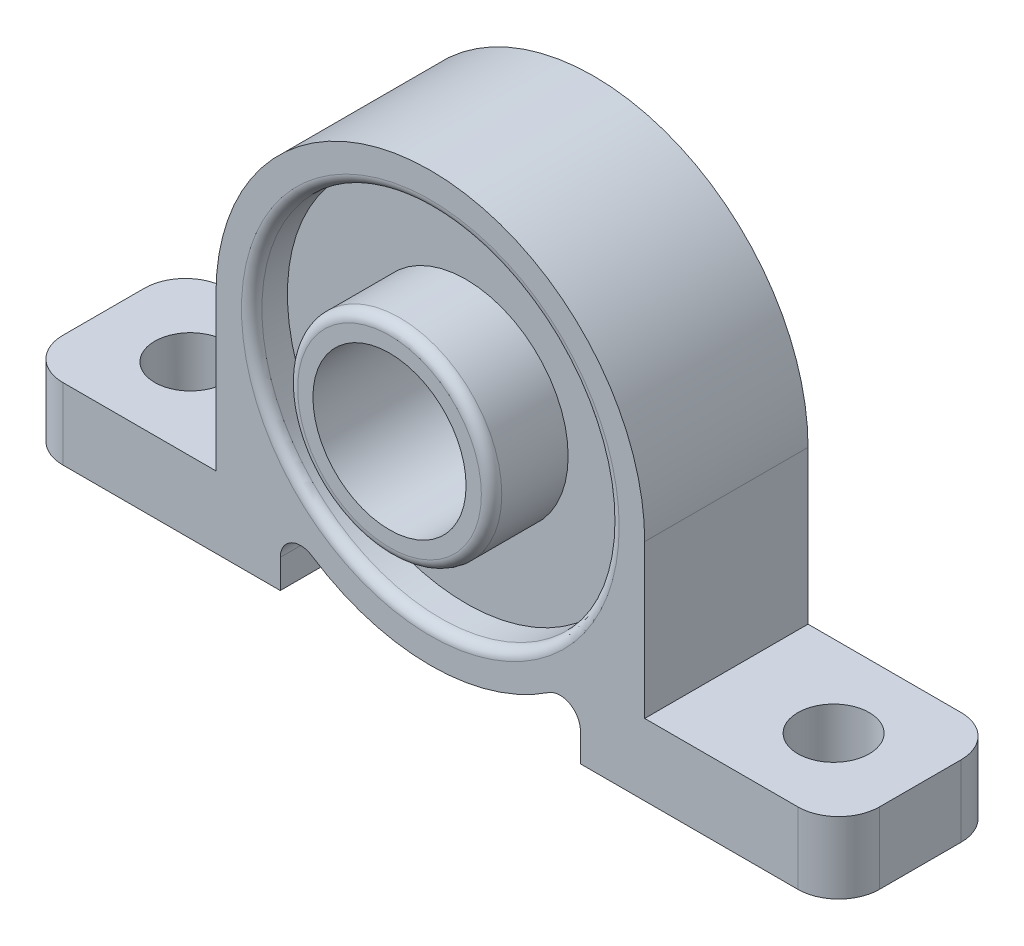
ISO-10303-21;
HEADER;
FILE_DESCRIPTION(('STEP AP214'),'2;1');
FILE_NAME('part.step','',(''),(''),'','','');
FILE_SCHEMA(('AUTOMOTIVE_DESIGN { 1 0 10303 214 1 1 1 1 }'));
ENDSEC;
DATA;
#1=APPLICATION_CONTEXT('core data for automotive mechanical design processes');
#2=APPLICATION_PROTOCOL_DEFINITION('international standard','automotive_design',2000,#1);
#3=PRODUCT_CONTEXT('',#1,'mechanical');
#4=PRODUCT('Part','Part','',(#3));
#5=PRODUCT_RELATED_PRODUCT_CATEGORY('part','',(#4));
#6=PRODUCT_DEFINITION_FORMATION('','',#4);
#7=PRODUCT_DEFINITION_CONTEXT('part definition',#1,'design');
#8=PRODUCT_DEFINITION('design','',#6,#7);
#9=PRODUCT_DEFINITION_SHAPE('','',#8);
#10=(LENGTH_UNIT() NAMED_UNIT(*) SI_UNIT(.MILLI.,.METRE.));
#11=(NAMED_UNIT(*) PLANE_ANGLE_UNIT() SI_UNIT($,.RADIAN.));
#12=(NAMED_UNIT(*) SI_UNIT($,.STERADIAN.) SOLID_ANGLE_UNIT());
#13=UNCERTAINTY_MEASURE_WITH_UNIT(LENGTH_MEASURE(1.E-05),#10,'distance_accuracy_value','');
#14=(GEOMETRIC_REPRESENTATION_CONTEXT(3) GLOBAL_UNCERTAINTY_ASSIGNED_CONTEXT((#13)) GLOBAL_UNIT_ASSIGNED_CONTEXT((#10,
#11,#12)) REPRESENTATION_CONTEXT('',''));
#15=CARTESIAN_POINT('',(0.,0.,0.));
#16=DIRECTION('',(0.,0.,1.));
#17=DIRECTION('',(1.,0.,0.));
#18=AXIS2_PLACEMENT_3D('',#15,#16,#17);
#19=CARTESIAN_POINT('',(0.,15.,16.));
#20=DIRECTION('',(0.,0.,-1.));
#21=DIRECTION('',(-1.,0.,0.));
#22=AXIS2_PLACEMENT_3D('',#19,#20,#21);
#23=CYLINDRICAL_SURFACE('',#22,7.5);
#24=CARTESIAN_POINT('',(0.,15.,4.5));
#25=DIRECTION('',(0.,0.,-1.));
#26=DIRECTION('',(-1.,0.,0.));
#27=AXIS2_PLACEMENT_3D('',#24,#25,#26);
#28=CIRCLE('',#27,7.5);
#29=CARTESIAN_POINT('',(-7.5,15.,4.5));
#30=VERTEX_POINT('',#29);
#31=EDGE_CURVE('E305',#30,#30,#28,.T.);
#32=ORIENTED_EDGE('',*,*,#31,.T.);
#33=EDGE_LOOP('',(#32));
#34=FACE_BOUND('',#33,.T.);
#35=CARTESIAN_POINT('',(0.,15.,20.));
#36=DIRECTION('',(0.,0.,1.));
#37=DIRECTION('',(1.,0.,0.));
#38=AXIS2_PLACEMENT_3D('',#35,#36,#37);
#39=CIRCLE('',#38,7.5);
#40=CARTESIAN_POINT('',(7.5,15.,20.));
#41=VERTEX_POINT('',#40);
#42=EDGE_CURVE('E213',#41,#41,#39,.T.);
#43=ORIENTED_EDGE('',*,*,#42,.T.);
#44=EDGE_LOOP('',(#43));
#45=FACE_BOUND('',#44,.T.);
#46=ADVANCED_FACE('F35',(#34,#45),#23,.F.);
#47=CARTESIAN_POINT('',(0.,15.,16.));
#48=DIRECTION('',(0.,0.,1.));
#49=DIRECTION('',(1.,0.,0.));
#50=AXIS2_PLACEMENT_3D('',#47,#48,#49);
#51=PLANE('',#50);
#52=CARTESIAN_POINT('',(0.,15.,16.));
#53=DIRECTION('',(0.,0.,1.));
#54=DIRECTION('',(1.,0.,0.));
#55=AXIS2_PLACEMENT_3D('',#52,#53,#54);
#56=CIRCLE('',#55,18.5);
#57=CARTESIAN_POINT('',(18.5,15.,16.));
#58=VERTEX_POINT('',#57);
#59=EDGE_CURVE('E320',#58,#58,#56,.F.);
#60=ORIENTED_EDGE('',*,*,#59,.T.);
#61=EDGE_LOOP('',(#60));
#62=FACE_BOUND('',#61,.T.);
#63=DIRECTION('',(-1.,0.,0.));
#64=VECTOR('',#63,1.);
#65=CARTESIAN_POINT('',(-40.,0.,16.));
#66=LINE('',#65,#64);
#67=CARTESIAN_POINT('',(-21.,0.,16.));
#68=VERTEX_POINT('',#67);
#69=CARTESIAN_POINT('',(-36.,0.,16.));
#70=VERTEX_POINT('',#69);
#71=EDGE_CURVE('E208',#68,#70,#66,.T.);
#72=ORIENTED_EDGE('',*,*,#71,.T.);
#73=DIRECTION('',(0.,-1.,0.));
#74=VECTOR('',#73,1.);
#75=CARTESIAN_POINT('',(-36.,-7.,16.));
#76=LINE('',#75,#74);
#77=CARTESIAN_POINT('',(-36.,-7.,16.));
#78=VERTEX_POINT('',#77);
#79=EDGE_CURVE('E172',#70,#78,#76,.T.);
#80=ORIENTED_EDGE('',*,*,#79,.T.);
#81=DIRECTION('',(1.,0.,0.));
#82=VECTOR('',#81,1.);
#83=CARTESIAN_POINT('',(-40.,-7.,16.));
#84=LINE('',#83,#82);
#85=CARTESIAN_POINT('',(-14.6969384566991,-7.,16.));
#86=VERTEX_POINT('',#85);
#87=EDGE_CURVE('E164',#78,#86,#84,.T.);
#88=ORIENTED_EDGE('',*,*,#87,.T.);
#89=DIRECTION('',(0.,1.,0.));
#90=VECTOR('',#89,1.);
#91=CARTESIAN_POINT('',(-14.6969384566991,0.,16.));
#92=LINE('',#91,#90);
#93=CARTESIAN_POINT('',(-14.6969384566991,-4.1777932470552,16.));
#94=VERTEX_POINT('',#93);
#95=EDGE_CURVE('E169',#86,#94,#92,.T.);
#96=ORIENTED_EDGE('',*,*,#95,.T.);
#97=CARTESIAN_POINT('',(-12.6969384566991,-4.17779324705521,16.));
#98=DIRECTION('',(0.,0.,1.));
#99=DIRECTION('',(1.,0.,0.));
#100=AXIS2_PLACEMENT_3D('',#97,#98,#99);
#101=CIRCLE('',#100,2.);
#102=CARTESIAN_POINT('',(-11.5928568517687,-2.5101590516591,16.));
#103=VERTEX_POINT('',#102);
#104=EDGE_CURVE('E301',#94,#103,#101,.F.);
#105=ORIENTED_EDGE('',*,*,#104,.T.);
#106=CARTESIAN_POINT('',(0.,15.,16.));
#107=DIRECTION('',(0.,0.,1.));
#108=DIRECTION('',(1.,0.,0.));
#109=AXIS2_PLACEMENT_3D('',#106,#107,#108);
#110=CIRCLE('',#109,21.);
#111=CARTESIAN_POINT('',(11.5928568517687,-2.5101590516591,16.));
#112=VERTEX_POINT('',#111);
#113=EDGE_CURVE('E190',#103,#112,#110,.T.);
#114=ORIENTED_EDGE('',*,*,#113,.T.);
#115=CARTESIAN_POINT('',(12.6969384566991,-4.17779324705521,16.));
#116=DIRECTION('',(0.,0.,1.));
#117=DIRECTION('',(1.,0.,0.));
#118=AXIS2_PLACEMENT_3D('',#115,#116,#117);
#119=CIRCLE('',#118,2.);
#120=CARTESIAN_POINT('',(14.6969384566991,-4.1777932470552,16.));
#121=VERTEX_POINT('',#120);
#122=EDGE_CURVE('E52',#112,#121,#119,.F.);
#123=ORIENTED_EDGE('',*,*,#122,.T.);
#124=DIRECTION('',(0.,-1.,0.));
#125=VECTOR('',#124,1.);
#126=CARTESIAN_POINT('',(14.6969384566991,0.,16.));
#127=LINE('',#126,#125);
#128=CARTESIAN_POINT('',(14.6969384566991,-7.,16.));
#129=VERTEX_POINT('',#128);
#130=EDGE_CURVE('E192',#121,#129,#127,.T.);
#131=ORIENTED_EDGE('',*,*,#130,.T.);
#132=DIRECTION('',(1.,0.,0.));
#133=VECTOR('',#132,1.);
#134=CARTESIAN_POINT('',(14.6969384566991,-7.,16.));
#135=LINE('',#134,#133);
#136=CARTESIAN_POINT('',(36.,-7.,16.));
#137=VERTEX_POINT('',#136);
#138=EDGE_CURVE('E197',#129,#137,#135,.T.);
#139=ORIENTED_EDGE('',*,*,#138,.T.);
#140=DIRECTION('',(0.,1.,0.));
#141=VECTOR('',#140,1.);
#142=CARTESIAN_POINT('',(36.,0.,16.));
#143=LINE('',#142,#141);
#144=CARTESIAN_POINT('',(36.,0.,16.));
#145=VERTEX_POINT('',#144);
#146=EDGE_CURVE('E257',#137,#145,#143,.T.);
#147=ORIENTED_EDGE('',*,*,#146,.T.);
#148=DIRECTION('',(-1.,0.,0.));
#149=VECTOR('',#148,1.);
#150=CARTESIAN_POINT('',(21.,0.,16.));
#151=LINE('',#150,#149);
#152=CARTESIAN_POINT('',(21.,0.,16.));
#153=VERTEX_POINT('',#152);
#154=EDGE_CURVE('E200',#145,#153,#151,.T.);
#155=ORIENTED_EDGE('',*,*,#154,.T.);
#156=DIRECTION('',(0.,1.,0.));
#157=VECTOR('',#156,1.);
#158=CARTESIAN_POINT('',(21.,15.,16.));
#159=LINE('',#158,#157);
#160=CARTESIAN_POINT('',(21.,15.,16.));
#161=VERTEX_POINT('',#160);
#162=EDGE_CURVE('E202',#153,#161,#159,.T.);
#163=ORIENTED_EDGE('',*,*,#162,.T.);
#164=CARTESIAN_POINT('',(0.,15.,16.));
#165=DIRECTION('',(0.,0.,1.));
#166=DIRECTION('',(1.,0.,0.));
#167=AXIS2_PLACEMENT_3D('',#164,#165,#166);
#168=CIRCLE('',#167,21.);
#169=CARTESIAN_POINT('',(-21.,15.,16.));
#170=VERTEX_POINT('',#169);
#171=EDGE_CURVE('E204',#161,#170,#168,.T.);
#172=ORIENTED_EDGE('',*,*,#171,.T.);
#173=DIRECTION('',(0.,-1.,0.));
#174=VECTOR('',#173,1.);
#175=CARTESIAN_POINT('',(-21.,15.,16.));
#176=LINE('',#175,#174);
#177=EDGE_CURVE('E206',#170,#68,#176,.T.);
#178=ORIENTED_EDGE('',*,*,#177,.T.);
#179=EDGE_LOOP('',(#72,#80,#88,#96,#105,#114,#123,#131,#139,#147,#155,#163,#172,#178));
#180=FACE_BOUND('',#179,.T.);
#181=ADVANCED_FACE('F167',(#62,#180),#51,.T.);
#182=CARTESIAN_POINT('',(0.,15.,0.));
#183=DIRECTION('',(0.,0.,1.));
#184=DIRECTION('',(1.,0.,0.));
#185=AXIS2_PLACEMENT_3D('',#182,#183,#184);
#186=PLANE('',#185);
#187=CARTESIAN_POINT('',(0.,15.,0.));
#188=DIRECTION('',(0.,0.,1.));
#189=DIRECTION('',(1.,0.,0.));
#190=AXIS2_PLACEMENT_3D('',#187,#188,#189);
#191=CIRCLE('',#190,18.);
#192=CARTESIAN_POINT('',(18.,15.,0.));
#193=VERTEX_POINT('',#192);
#194=EDGE_CURVE('E314',#193,#193,#191,.T.);
#195=ORIENTED_EDGE('',*,*,#194,.T.);
#196=EDGE_LOOP('',(#195));
#197=FACE_BOUND('',#196,.T.);
#198=DIRECTION('',(1.,0.,0.));
#199=VECTOR('',#198,1.);
#200=CARTESIAN_POINT('',(-40.,-7.,0.));
#201=LINE('',#200,#199);
#202=CARTESIAN_POINT('',(-36.,-7.,0.));
#203=VERTEX_POINT('',#202);
#204=CARTESIAN_POINT('',(-14.6969384566991,-7.,0.));
#205=VERTEX_POINT('',#204);
#206=EDGE_CURVE('E180',#203,#205,#201,.T.);
#207=ORIENTED_EDGE('',*,*,#206,.F.);
#208=DIRECTION('',(0.,-1.,0.));
#209=VECTOR('',#208,1.);
#210=CARTESIAN_POINT('',(-36.,15.,0.));
#211=LINE('',#210,#209);
#212=CARTESIAN_POINT('',(-36.,0.,0.));
#213=VERTEX_POINT('',#212);
#214=EDGE_CURVE('E276',#203,#213,#211,.F.);
#215=ORIENTED_EDGE('',*,*,#214,.T.);
#216=DIRECTION('',(-1.,0.,0.));
#217=VECTOR('',#216,1.);
#218=CARTESIAN_POINT('',(-40.,0.,0.));
#219=LINE('',#218,#217);
#220=CARTESIAN_POINT('',(-21.,0.,0.));
#221=VERTEX_POINT('',#220);
#222=EDGE_CURVE('E174',#221,#213,#219,.T.);
#223=ORIENTED_EDGE('',*,*,#222,.F.);
#224=DIRECTION('',(0.,-1.,0.));
#225=VECTOR('',#224,1.);
#226=CARTESIAN_POINT('',(-21.,15.,0.));
#227=LINE('',#226,#225);
#228=CARTESIAN_POINT('',(-21.,15.,0.));
#229=VERTEX_POINT('',#228);
#230=EDGE_CURVE('E229',#229,#221,#227,.T.);
#231=ORIENTED_EDGE('',*,*,#230,.F.);
#232=CARTESIAN_POINT('',(0.,15.,0.));
#233=DIRECTION('',(0.,0.,1.));
#234=DIRECTION('',(1.,0.,0.));
#235=AXIS2_PLACEMENT_3D('',#232,#233,#234);
#236=CIRCLE('',#235,21.);
#237=CARTESIAN_POINT('',(21.,15.,0.));
#238=VERTEX_POINT('',#237);
#239=EDGE_CURVE('E227',#238,#229,#236,.T.);
#240=ORIENTED_EDGE('',*,*,#239,.F.);
#241=DIRECTION('',(0.,1.,0.));
#242=VECTOR('',#241,1.);
#243=CARTESIAN_POINT('',(21.,15.,0.));
#244=LINE('',#243,#242);
#245=CARTESIAN_POINT('',(21.,0.,0.));
#246=VERTEX_POINT('',#245);
#247=EDGE_CURVE('E225',#246,#238,#244,.T.);
#248=ORIENTED_EDGE('',*,*,#247,.F.);
#249=DIRECTION('',(-1.,0.,0.));
#250=VECTOR('',#249,1.);
#251=CARTESIAN_POINT('',(21.,0.,0.));
#252=LINE('',#251,#250);
#253=CARTESIAN_POINT('',(36.,0.,0.));
#254=VERTEX_POINT('',#253);
#255=EDGE_CURVE('E223',#254,#246,#252,.T.);
#256=ORIENTED_EDGE('',*,*,#255,.F.);
#257=DIRECTION('',(0.,1.,0.));
#258=VECTOR('',#257,1.);
#259=CARTESIAN_POINT('',(36.,15.,0.));
#260=LINE('',#259,#258);
#261=CARTESIAN_POINT('',(36.,-7.,0.));
#262=VERTEX_POINT('',#261);
#263=EDGE_CURVE('E274',#254,#262,#260,.F.);
#264=ORIENTED_EDGE('',*,*,#263,.T.);
#265=DIRECTION('',(1.,0.,0.));
#266=VECTOR('',#265,1.);
#267=CARTESIAN_POINT('',(14.6969384566991,-7.,0.));
#268=LINE('',#267,#266);
#269=CARTESIAN_POINT('',(14.6969384566991,-7.,0.));
#270=VERTEX_POINT('',#269);
#271=EDGE_CURVE('E220',#270,#262,#268,.T.);
#272=ORIENTED_EDGE('',*,*,#271,.F.);
#273=DIRECTION('',(0.,-1.,0.));
#274=VECTOR('',#273,1.);
#275=CARTESIAN_POINT('',(14.6969384566991,0.,0.));
#276=LINE('',#275,#274);
#277=CARTESIAN_POINT('',(14.6969384566991,-4.1777932470552,0.));
#278=VERTEX_POINT('',#277);
#279=EDGE_CURVE('E218',#278,#270,#276,.T.);
#280=ORIENTED_EDGE('',*,*,#279,.F.);
#281=CARTESIAN_POINT('',(12.6969384566991,-4.17779324705521,0.));
#282=DIRECTION('',(0.,0.,1.));
#283=DIRECTION('',(1.,0.,0.));
#284=AXIS2_PLACEMENT_3D('',#281,#282,#283);
#285=CIRCLE('',#284,2.);
#286=CARTESIAN_POINT('',(11.5928568517687,-2.5101590516591,0.));
#287=VERTEX_POINT('',#286);
#288=EDGE_CURVE('E60',#278,#287,#285,.T.);
#289=ORIENTED_EDGE('',*,*,#288,.T.);
#290=CARTESIAN_POINT('',(0.,15.,0.));
#291=DIRECTION('',(0.,0.,1.));
#292=DIRECTION('',(1.,0.,0.));
#293=AXIS2_PLACEMENT_3D('',#290,#291,#292);
#294=CIRCLE('',#293,21.);
#295=CARTESIAN_POINT('',(-11.5928568517687,-2.5101590516591,0.));
#296=VERTEX_POINT('',#295);
#297=EDGE_CURVE('E215',#296,#287,#294,.T.);
#298=ORIENTED_EDGE('',*,*,#297,.F.);
#299=CARTESIAN_POINT('',(-12.6969384566991,-4.17779324705521,0.));
#300=DIRECTION('',(0.,0.,1.));
#301=DIRECTION('',(1.,0.,0.));
#302=AXIS2_PLACEMENT_3D('',#299,#300,#301);
#303=CIRCLE('',#302,2.);
#304=CARTESIAN_POINT('',(-14.6969384566991,-4.1777932470552,0.));
#305=VERTEX_POINT('',#304);
#306=EDGE_CURVE('E299',#296,#305,#303,.T.);
#307=ORIENTED_EDGE('',*,*,#306,.T.);
#308=DIRECTION('',(0.,1.,0.));
#309=VECTOR('',#308,1.);
#310=CARTESIAN_POINT('',(-14.6969384566991,0.,0.));
#311=LINE('',#310,#309);
#312=EDGE_CURVE('E212',#205,#305,#311,.T.);
#313=ORIENTED_EDGE('',*,*,#312,.F.);
#314=EDGE_LOOP('',(#207,#215,#223,#231,#240,#248,#256,#264,#272,#280,#289,#298,#307,#313));
#315=FACE_BOUND('',#314,.T.);
#316=ADVANCED_FACE('F372',(#197,#315),#186,.F.);
#317=CARTESIAN_POINT('',(-40.,0.,16.));
#318=DIRECTION('',(1.,0.,0.));
#319=DIRECTION('',(0.,0.,-1.));
#320=AXIS2_PLACEMENT_3D('',#317,#318,#319);
#321=PLANE('',#320);
#322=DIRECTION('',(0.,0.,-1.));
#323=VECTOR('',#322,1.);
#324=CARTESIAN_POINT('',(-40.,-7.,16.));
#325=LINE('',#324,#323);
#326=CARTESIAN_POINT('',(-40.,-7.,12.));
#327=VERTEX_POINT('',#326);
#328=CARTESIAN_POINT('',(-40.,-7.,4.));
#329=VERTEX_POINT('',#328);
#330=EDGE_CURVE('E184',#327,#329,#325,.T.);
#331=ORIENTED_EDGE('',*,*,#330,.F.);
#332=DIRECTION('',(0.,-1.,0.));
#333=VECTOR('',#332,1.);
#334=CARTESIAN_POINT('',(-40.,0.,12.));
#335=LINE('',#334,#333);
#336=CARTESIAN_POINT('',(-40.,0.,12.));
#337=VERTEX_POINT('',#336);
#338=EDGE_CURVE('E268',#327,#337,#335,.F.);
#339=ORIENTED_EDGE('',*,*,#338,.T.);
#340=DIRECTION('',(0.,0.,-1.));
#341=VECTOR('',#340,1.);
#342=CARTESIAN_POINT('',(-40.,0.,16.));
#343=LINE('',#342,#341);
#344=CARTESIAN_POINT('',(-40.,0.,4.));
#345=VERTEX_POINT('',#344);
#346=EDGE_CURVE('E210',#337,#345,#343,.T.);
#347=ORIENTED_EDGE('',*,*,#346,.T.);
#348=DIRECTION('',(0.,-1.,0.));
#349=VECTOR('',#348,1.);
#350=CARTESIAN_POINT('',(-40.,0.,4.));
#351=LINE('',#350,#349);
#352=EDGE_CURVE('E265',#345,#329,#351,.T.);
#353=ORIENTED_EDGE('',*,*,#352,.T.);
#354=EDGE_LOOP('',(#331,#339,#347,#353));
#355=FACE_BOUND('',#354,.T.);
#356=ADVANCED_FACE('F377',(#355),#321,.F.);
#357=CARTESIAN_POINT('',(-40.,-7.,16.));
#358=DIRECTION('',(0.,1.,0.));
#359=DIRECTION('',(-1.,0.,0.));
#360=AXIS2_PLACEMENT_3D('',#357,#358,#359);
#361=PLANE('',#360);
#362=CARTESIAN_POINT('',(-31.5,-7.,8.));
#363=DIRECTION('',(0.,1.,0.));
#364=DIRECTION('',(0.,0.,1.));
#365=AXIS2_PLACEMENT_3D('',#362,#363,#364);
#366=CIRCLE('',#365,3.5);
#367=CARTESIAN_POINT('',(-31.5,-7.,11.5));
#368=VERTEX_POINT('',#367);
#369=EDGE_CURVE('E326',#368,#368,#366,.T.);
#370=ORIENTED_EDGE('',*,*,#369,.T.);
#371=EDGE_LOOP('',(#370));
#372=FACE_BOUND('',#371,.T.);
#373=ORIENTED_EDGE('',*,*,#87,.F.);
#374=CARTESIAN_POINT('',(-36.,-7.,12.));
#375=DIRECTION('',(0.,1.,0.));
#376=DIRECTION('',(-1.,0.,0.));
#377=AXIS2_PLACEMENT_3D('',#374,#375,#376);
#378=CIRCLE('',#377,4.);
#379=EDGE_CURVE('E263',#78,#327,#378,.F.);
#380=ORIENTED_EDGE('',*,*,#379,.T.);
#381=ORIENTED_EDGE('',*,*,#330,.T.);
#382=CARTESIAN_POINT('',(-36.,-7.,4.));
#383=DIRECTION('',(0.,1.,0.));
#384=DIRECTION('',(-1.,0.,0.));
#385=AXIS2_PLACEMENT_3D('',#382,#383,#384);
#386=CIRCLE('',#385,4.);
#387=EDGE_CURVE('E261',#329,#203,#386,.F.);
#388=ORIENTED_EDGE('',*,*,#387,.T.);
#389=ORIENTED_EDGE('',*,*,#206,.T.);
#390=DIRECTION('',(0.,0.,-1.));
#391=VECTOR('',#390,1.);
#392=CARTESIAN_POINT('',(-14.6969384566991,-7.,16.));
#393=LINE('',#392,#391);
#394=EDGE_CURVE('E177',#86,#205,#393,.T.);
#395=ORIENTED_EDGE('',*,*,#394,.F.);
#396=EDGE_LOOP('',(#373,#380,#381,#388,#389,#395));
#397=FACE_BOUND('',#396,.T.);
#398=ADVANCED_FACE('F178',(#372,#397),#361,.F.);
#399=CARTESIAN_POINT('',(-14.6969384566991,0.,16.));
#400=DIRECTION('',(-1.,0.,0.));
#401=DIRECTION('',(0.,0.,1.));
#402=AXIS2_PLACEMENT_3D('',#399,#400,#401);
#403=PLANE('',#402);
#404=ORIENTED_EDGE('',*,*,#312,.T.);
#405=DIRECTION('',(0.,0.,1.));
#406=VECTOR('',#405,1.);
#407=CARTESIAN_POINT('',(-14.6969384566991,-4.17779324705521,16.));
#408=LINE('',#407,#406);
#409=EDGE_CURVE('E189',#305,#94,#408,.T.);
#410=ORIENTED_EDGE('',*,*,#409,.T.);
#411=ORIENTED_EDGE('',*,*,#95,.F.);
#412=ORIENTED_EDGE('',*,*,#394,.T.);
#413=EDGE_LOOP('',(#404,#410,#411,#412));
#414=FACE_BOUND('',#413,.T.);
#415=ADVANCED_FACE('F187',(#414),#403,.F.);
#416=CARTESIAN_POINT('',(0.,15.,16.));
#417=DIRECTION('',(0.,0.,-1.));
#418=DIRECTION('',(-1.,0.,0.));
#419=AXIS2_PLACEMENT_3D('',#416,#417,#418);
#420=CYLINDRICAL_SURFACE('',#419,21.);
#421=ORIENTED_EDGE('',*,*,#113,.F.);
#422=DIRECTION('',(0.,0.,-1.));
#423=VECTOR('',#422,1.);
#424=CARTESIAN_POINT('',(-11.5928568517687,-2.51015905165911,16.));
#425=LINE('',#424,#423);
#426=EDGE_CURVE('E293',#103,#296,#425,.T.);
#427=ORIENTED_EDGE('',*,*,#426,.T.);
#428=ORIENTED_EDGE('',*,*,#297,.T.);
#429=DIRECTION('',(0.,0.,-1.));
#430=VECTOR('',#429,1.);
#431=CARTESIAN_POINT('',(11.5928568517687,-2.51015905165911,16.));
#432=LINE('',#431,#430);
#433=EDGE_CURVE('E291',#287,#112,#432,.F.);
#434=ORIENTED_EDGE('',*,*,#433,.T.);
#435=EDGE_LOOP('',(#421,#427,#428,#434));
#436=FACE_BOUND('',#435,.T.);
#437=ADVANCED_FACE('F406',(#436),#420,.T.);
#438=CARTESIAN_POINT('',(14.6969384566991,0.,16.));
#439=DIRECTION('',(1.,0.,0.));
#440=DIRECTION('',(0.,1.,0.));
#441=AXIS2_PLACEMENT_3D('',#438,#439,#440);
#442=PLANE('',#441);
#443=ORIENTED_EDGE('',*,*,#130,.F.);
#444=DIRECTION('',(0.,0.,1.));
#445=VECTOR('',#444,1.);
#446=CARTESIAN_POINT('',(14.6969384566991,-4.17779324705521,0.));
#447=LINE('',#446,#445);
#448=EDGE_CURVE('E297',#121,#278,#447,.F.);
#449=ORIENTED_EDGE('',*,*,#448,.T.);
#450=ORIENTED_EDGE('',*,*,#279,.T.);
#451=DIRECTION('',(0.,0.,-1.));
#452=VECTOR('',#451,1.);
#453=CARTESIAN_POINT('',(14.6969384566991,-7.,16.));
#454=LINE('',#453,#452);
#455=EDGE_CURVE('E185',#129,#270,#454,.T.);
#456=ORIENTED_EDGE('',*,*,#455,.F.);
#457=EDGE_LOOP('',(#443,#449,#450,#456));
#458=FACE_BOUND('',#457,.T.);
#459=ADVANCED_FACE('F402',(#458),#442,.F.);
#460=CARTESIAN_POINT('',(14.6969384566991,-7.,16.));
#461=DIRECTION('',(0.,1.,0.));
#462=DIRECTION('',(-1.,0.,0.));
#463=AXIS2_PLACEMENT_3D('',#460,#461,#462);
#464=PLANE('',#463);
#465=CARTESIAN_POINT('',(31.5,-7.,7.99999999999999));
#466=DIRECTION('',(0.,1.,0.));
#467=DIRECTION('',(0.,0.,-1.));
#468=AXIS2_PLACEMENT_3D('',#465,#466,#467);
#469=CIRCLE('',#468,3.5);
#470=CARTESIAN_POINT('',(31.5,-7.,4.49999999999999));
#471=VERTEX_POINT('',#470);
#472=EDGE_CURVE('E332',#471,#471,#469,.T.);
#473=ORIENTED_EDGE('',*,*,#472,.T.);
#474=EDGE_LOOP('',(#473));
#475=FACE_BOUND('',#474,.T.);
#476=DIRECTION('',(0.,0.,-1.));
#477=VECTOR('',#476,1.);
#478=CARTESIAN_POINT('',(40.,-7.,16.));
#479=LINE('',#478,#477);
#480=CARTESIAN_POINT('',(40.,-7.,12.));
#481=VERTEX_POINT('',#480);
#482=CARTESIAN_POINT('',(40.,-7.,4.));
#483=VERTEX_POINT('',#482);
#484=EDGE_CURVE('E250',#481,#483,#479,.T.);
#485=ORIENTED_EDGE('',*,*,#484,.F.);
#486=CARTESIAN_POINT('',(36.,-7.,12.));
#487=DIRECTION('',(0.,1.,0.));
#488=DIRECTION('',(-1.,0.,0.));
#489=AXIS2_PLACEMENT_3D('',#486,#487,#488);
#490=CIRCLE('',#489,4.);
#491=EDGE_CURVE('E289',#481,#137,#490,.F.);
#492=ORIENTED_EDGE('',*,*,#491,.T.);
#493=ORIENTED_EDGE('',*,*,#138,.F.);
#494=ORIENTED_EDGE('',*,*,#455,.T.);
#495=ORIENTED_EDGE('',*,*,#271,.T.);
#496=CARTESIAN_POINT('',(36.,-7.,4.));
#497=DIRECTION('',(0.,1.,0.));
#498=DIRECTION('',(-1.,0.,0.));
#499=AXIS2_PLACEMENT_3D('',#496,#497,#498);
#500=CIRCLE('',#499,4.);
#501=EDGE_CURVE('E287',#262,#483,#500,.F.);
#502=ORIENTED_EDGE('',*,*,#501,.T.);
#503=EDGE_LOOP('',(#485,#492,#493,#494,#495,#502));
#504=FACE_BOUND('',#503,.T.);
#505=ADVANCED_FACE('F398',(#475,#504),#464,.F.);
#506=CARTESIAN_POINT('',(40.,0.,16.));
#507=DIRECTION('',(-1.,0.,0.));
#508=DIRECTION('',(0.,0.,1.));
#509=AXIS2_PLACEMENT_3D('',#506,#507,#508);
#510=PLANE('',#509);
#511=DIRECTION('',(0.,0.,-1.));
#512=VECTOR('',#511,1.);
#513=CARTESIAN_POINT('',(40.,0.,16.));
#514=LINE('',#513,#512);
#515=CARTESIAN_POINT('',(40.,0.,12.));
#516=VERTEX_POINT('',#515);
#517=CARTESIAN_POINT('',(40.,0.,4.));
#518=VERTEX_POINT('',#517);
#519=EDGE_CURVE('E247',#516,#518,#514,.T.);
#520=ORIENTED_EDGE('',*,*,#519,.F.);
#521=DIRECTION('',(0.,1.,0.));
#522=VECTOR('',#521,1.);
#523=CARTESIAN_POINT('',(40.,-7.,12.));
#524=LINE('',#523,#522);
#525=EDGE_CURVE('E285',#516,#481,#524,.F.);
#526=ORIENTED_EDGE('',*,*,#525,.T.);
#527=ORIENTED_EDGE('',*,*,#484,.T.);
#528=DIRECTION('',(0.,1.,0.));
#529=VECTOR('',#528,1.);
#530=CARTESIAN_POINT('',(40.,0.,4.));
#531=LINE('',#530,#529);
#532=EDGE_CURVE('E282',#483,#518,#531,.T.);
#533=ORIENTED_EDGE('',*,*,#532,.T.);
#534=EDGE_LOOP('',(#520,#526,#527,#533));
#535=FACE_BOUND('',#534,.T.);
#536=ADVANCED_FACE('F394',(#535),#510,.F.);
#537=CARTESIAN_POINT('',(21.,0.,16.));
#538=DIRECTION('',(0.,-1.,0.));
#539=DIRECTION('',(0.,0.,-1.));
#540=AXIS2_PLACEMENT_3D('',#537,#538,#539);
#541=PLANE('',#540);
#542=CARTESIAN_POINT('',(31.5,0.,7.99999999999999));
#543=DIRECTION('',(0.,-1.,0.));
#544=DIRECTION('',(0.,0.,-1.));
#545=AXIS2_PLACEMENT_3D('',#542,#543,#544);
#546=CIRCLE('',#545,3.5);
#547=CARTESIAN_POINT('',(31.5,0.,4.49999999999999));
#548=VERTEX_POINT('',#547);
#549=EDGE_CURVE('E39',#548,#548,#546,.T.);
#550=ORIENTED_EDGE('',*,*,#549,.T.);
#551=EDGE_LOOP('',(#550));
#552=FACE_BOUND('',#551,.T.);
#553=ORIENTED_EDGE('',*,*,#154,.F.);
#554=CARTESIAN_POINT('',(36.,0.,12.));
#555=DIRECTION('',(0.,-1.,0.));
#556=DIRECTION('',(0.,0.,-1.));
#557=AXIS2_PLACEMENT_3D('',#554,#555,#556);
#558=CIRCLE('',#557,4.);
#559=EDGE_CURVE('E280',#145,#516,#558,.F.);
#560=ORIENTED_EDGE('',*,*,#559,.T.);
#561=ORIENTED_EDGE('',*,*,#519,.T.);
#562=CARTESIAN_POINT('',(36.,0.,4.));
#563=DIRECTION('',(0.,-1.,0.));
#564=DIRECTION('',(0.,0.,-1.));
#565=AXIS2_PLACEMENT_3D('',#562,#563,#564);
#566=CIRCLE('',#565,4.);
#567=EDGE_CURVE('E278',#518,#254,#566,.F.);
#568=ORIENTED_EDGE('',*,*,#567,.T.);
#569=ORIENTED_EDGE('',*,*,#255,.T.);
#570=DIRECTION('',(0.,0.,-1.));
#571=VECTOR('',#570,1.);
#572=CARTESIAN_POINT('',(21.,0.,16.));
#573=LINE('',#572,#571);
#574=EDGE_CURVE('E244',#153,#246,#573,.T.);
#575=ORIENTED_EDGE('',*,*,#574,.F.);
#576=EDGE_LOOP('',(#553,#560,#561,#568,#569,#575));
#577=FACE_BOUND('',#576,.T.);
#578=ADVANCED_FACE('F390',(#552,#577),#541,.F.);
#579=CARTESIAN_POINT('',(21.,15.,16.));
#580=DIRECTION('',(-1.,0.,0.));
#581=DIRECTION('',(0.,-1.,0.));
#582=AXIS2_PLACEMENT_3D('',#579,#580,#581);
#583=PLANE('',#582);
#584=ORIENTED_EDGE('',*,*,#247,.T.);
#585=DIRECTION('',(0.,0.,-1.));
#586=VECTOR('',#585,1.);
#587=CARTESIAN_POINT('',(21.,15.,16.));
#588=LINE('',#587,#586);
#589=EDGE_CURVE('E241',#161,#238,#588,.T.);
#590=ORIENTED_EDGE('',*,*,#589,.F.);
#591=ORIENTED_EDGE('',*,*,#162,.F.);
#592=ORIENTED_EDGE('',*,*,#574,.T.);
#593=EDGE_LOOP('',(#584,#590,#591,#592));
#594=FACE_BOUND('',#593,.T.);
#595=ADVANCED_FACE('F386',(#594),#583,.F.);
#596=CARTESIAN_POINT('',(0.,15.,16.));
#597=DIRECTION('',(0.,0.,-1.));
#598=DIRECTION('',(-1.,0.,0.));
#599=AXIS2_PLACEMENT_3D('',#596,#597,#598);
#600=CYLINDRICAL_SURFACE('',#599,21.);
#601=ORIENTED_EDGE('',*,*,#239,.T.);
#602=DIRECTION('',(0.,0.,-1.));
#603=VECTOR('',#602,1.);
#604=CARTESIAN_POINT('',(-21.,15.,16.));
#605=LINE('',#604,#603);
#606=EDGE_CURVE('E238',#170,#229,#605,.T.);
#607=ORIENTED_EDGE('',*,*,#606,.F.);
#608=ORIENTED_EDGE('',*,*,#171,.F.);
#609=ORIENTED_EDGE('',*,*,#589,.T.);
#610=EDGE_LOOP('',(#601,#607,#608,#609));
#611=FACE_BOUND('',#610,.T.);
#612=ADVANCED_FACE('F382',(#611),#600,.T.);
#613=CARTESIAN_POINT('',(-21.,15.,16.));
#614=DIRECTION('',(1.,0.,0.));
#615=DIRECTION('',(0.,0.,-1.));
#616=AXIS2_PLACEMENT_3D('',#613,#614,#615);
#617=PLANE('',#616);
#618=ORIENTED_EDGE('',*,*,#230,.T.);
#619=DIRECTION('',(0.,0.,-1.));
#620=VECTOR('',#619,1.);
#621=CARTESIAN_POINT('',(-21.,0.,16.));
#622=LINE('',#621,#620);
#623=EDGE_CURVE('E235',#68,#221,#622,.T.);
#624=ORIENTED_EDGE('',*,*,#623,.F.);
#625=ORIENTED_EDGE('',*,*,#177,.F.);
#626=ORIENTED_EDGE('',*,*,#606,.T.);
#627=EDGE_LOOP('',(#618,#624,#625,#626));
#628=FACE_BOUND('',#627,.T.);
#629=ADVANCED_FACE('F363',(#628),#617,.F.);
#630=CARTESIAN_POINT('',(-40.,0.,16.));
#631=DIRECTION('',(0.,-1.,0.));
#632=DIRECTION('',(0.,0.,-1.));
#633=AXIS2_PLACEMENT_3D('',#630,#631,#632);
#634=PLANE('',#633);
#635=CARTESIAN_POINT('',(-31.5,0.,8.));
#636=DIRECTION('',(0.,-1.,0.));
#637=DIRECTION('',(0.,0.,-1.));
#638=AXIS2_PLACEMENT_3D('',#635,#636,#637);
#639=CIRCLE('',#638,3.5);
#640=CARTESIAN_POINT('',(-31.5,0.,4.5));
#641=VERTEX_POINT('',#640);
#642=EDGE_CURVE('E324',#641,#641,#639,.T.);
#643=ORIENTED_EDGE('',*,*,#642,.T.);
#644=EDGE_LOOP('',(#643));
#645=FACE_BOUND('',#644,.T.);
#646=ORIENTED_EDGE('',*,*,#346,.F.);
#647=CARTESIAN_POINT('',(-36.,0.,12.));
#648=DIRECTION('',(0.,-1.,0.));
#649=DIRECTION('',(0.,0.,-1.));
#650=AXIS2_PLACEMENT_3D('',#647,#648,#649);
#651=CIRCLE('',#650,4.);
#652=EDGE_CURVE('E272',#337,#70,#651,.F.);
#653=ORIENTED_EDGE('',*,*,#652,.T.);
#654=ORIENTED_EDGE('',*,*,#71,.F.);
#655=ORIENTED_EDGE('',*,*,#623,.T.);
#656=ORIENTED_EDGE('',*,*,#222,.T.);
#657=CARTESIAN_POINT('',(-36.,0.,4.));
#658=DIRECTION('',(0.,-1.,0.));
#659=DIRECTION('',(0.,0.,-1.));
#660=AXIS2_PLACEMENT_3D('',#657,#658,#659);
#661=CIRCLE('',#660,4.);
#662=EDGE_CURVE('E270',#213,#345,#661,.F.);
#663=ORIENTED_EDGE('',*,*,#662,.T.);
#664=EDGE_LOOP('',(#646,#653,#654,#655,#656,#663));
#665=FACE_BOUND('',#664,.T.);
#666=ADVANCED_FACE('F353',(#645,#665),#634,.F.);
#667=CARTESIAN_POINT('',(0.,15.,20.));
#668=DIRECTION('',(0.,0.,1.));
#669=DIRECTION('',(1.,0.,0.));
#670=AXIS2_PLACEMENT_3D('',#667,#668,#669);
#671=PLANE('',#670);
#672=CARTESIAN_POINT('',(0.,15.,20.));
#673=DIRECTION('',(0.,0.,1.));
#674=DIRECTION('',(1.,0.,0.));
#675=AXIS2_PLACEMENT_3D('',#672,#673,#674);
#676=CIRCLE('',#675,9.);
#677=CARTESIAN_POINT('',(9.,15.,20.));
#678=VERTEX_POINT('',#677);
#679=EDGE_CURVE('E44',#678,#678,#676,.T.);
#680=ORIENTED_EDGE('',*,*,#679,.T.);
#681=EDGE_LOOP('',(#680));
#682=FACE_BOUND('',#681,.T.);
#683=ORIENTED_EDGE('',*,*,#42,.F.);
#684=EDGE_LOOP('',(#683));
#685=FACE_BOUND('',#684,.T.);
#686=ADVANCED_FACE('F350',(#682,#685),#671,.T.);
#687=CARTESIAN_POINT('',(0.,15.,20.));
#688=DIRECTION('',(0.,0.,-1.));
#689=DIRECTION('',(-1.,0.,0.));
#690=AXIS2_PLACEMENT_3D('',#687,#688,#689);
#691=CYLINDRICAL_SURFACE('',#690,10.);
#692=CARTESIAN_POINT('',(0.,15.,19.));
#693=DIRECTION('',(0.,0.,1.));
#694=DIRECTION('',(1.,0.,0.));
#695=AXIS2_PLACEMENT_3D('',#692,#693,#694);
#696=CIRCLE('',#695,10.);
#697=CARTESIAN_POINT('',(10.,15.,19.));
#698=VERTEX_POINT('',#697);
#699=EDGE_CURVE('E11',#698,#698,#696,.F.);
#700=ORIENTED_EDGE('',*,*,#699,.T.);
#701=EDGE_LOOP('',(#700));
#702=FACE_BOUND('',#701,.T.);
#703=CARTESIAN_POINT('',(0.,15.,12.5));
#704=DIRECTION('',(0.,0.,1.));
#705=DIRECTION('',(1.,0.,0.));
#706=AXIS2_PLACEMENT_3D('',#703,#704,#705);
#707=CIRCLE('',#706,10.);
#708=CARTESIAN_POINT('',(10.,15.,12.5));
#709=VERTEX_POINT('',#708);
#710=EDGE_CURVE('E341',#709,#709,#707,.T.);
#711=ORIENTED_EDGE('',*,*,#710,.T.);
#712=EDGE_LOOP('',(#711));
#713=FACE_BOUND('',#712,.T.);
#714=ADVANCED_FACE('F352',(#702,#713),#691,.T.);
#715=CARTESIAN_POINT('',(0.,15.,12.5));
#716=DIRECTION('',(0.,0.,1.));
#717=DIRECTION('',(1.,0.,0.));
#718=AXIS2_PLACEMENT_3D('',#715,#716,#717);
#719=CYLINDRICAL_SURFACE('',#718,17.5);
#720=CARTESIAN_POINT('',(0.,15.,15.));
#721=DIRECTION('',(0.,0.,1.));
#722=DIRECTION('',(1.,0.,0.));
#723=AXIS2_PLACEMENT_3D('',#720,#721,#722);
#724=CIRCLE('',#723,17.5);
#725=CARTESIAN_POINT('',(17.5,15.,15.));
#726=VERTEX_POINT('',#725);
#727=EDGE_CURVE('E317',#726,#726,#724,.T.);
#728=ORIENTED_EDGE('',*,*,#727,.T.);
#729=EDGE_LOOP('',(#728));
#730=FACE_BOUND('',#729,.T.);
#731=CARTESIAN_POINT('',(0.,15.,12.5));
#732=DIRECTION('',(0.,0.,1.));
#733=DIRECTION('',(1.,0.,0.));
#734=AXIS2_PLACEMENT_3D('',#731,#732,#733);
#735=CIRCLE('',#734,17.5);
#736=CARTESIAN_POINT('',(17.5,15.,12.5));
#737=VERTEX_POINT('',#736);
#738=EDGE_CURVE('E344',#737,#737,#735,.T.);
#739=ORIENTED_EDGE('',*,*,#738,.F.);
#740=EDGE_LOOP('',(#739));
#741=FACE_BOUND('',#740,.T.);
#742=ADVANCED_FACE('F360',(#730,#741),#719,.F.);
#743=CARTESIAN_POINT('',(0.,15.,12.5));
#744=DIRECTION('',(0.,0.,1.));
#745=DIRECTION('',(1.,0.,0.));
#746=AXIS2_PLACEMENT_3D('',#743,#744,#745);
#747=PLANE('',#746);
#748=ORIENTED_EDGE('',*,*,#710,.F.);
#749=EDGE_LOOP('',(#748));
#750=FACE_BOUND('',#749,.T.);
#751=ORIENTED_EDGE('',*,*,#738,.T.);
#752=EDGE_LOOP('',(#751));
#753=FACE_BOUND('',#752,.T.);
#754=ADVANCED_FACE('F463',(#750,#753),#747,.T.);
#755=CARTESIAN_POINT('',(0.,15.,3.5));
#756=DIRECTION('',(0.,0.,-1.));
#757=DIRECTION('',(-1.,0.,0.));
#758=AXIS2_PLACEMENT_3D('',#755,#756,#757);
#759=CYLINDRICAL_SURFACE('',#758,17.);
#760=CARTESIAN_POINT('',(0.,15.,1.));
#761=DIRECTION('',(0.,0.,1.));
#762=DIRECTION('',(1.,0.,0.));
#763=AXIS2_PLACEMENT_3D('',#760,#761,#762);
#764=CIRCLE('',#763,17.);
#765=CARTESIAN_POINT('',(17.,15.,1.));
#766=VERTEX_POINT('',#765);
#767=EDGE_CURVE('E311',#766,#766,#764,.F.);
#768=ORIENTED_EDGE('',*,*,#767,.T.);
#769=EDGE_LOOP('',(#768));
#770=FACE_BOUND('',#769,.T.);
#771=CARTESIAN_POINT('',(0.,15.,3.5));
#772=DIRECTION('',(0.,0.,-1.));
#773=DIRECTION('',(-1.,0.,0.));
#774=AXIS2_PLACEMENT_3D('',#771,#772,#773);
#775=CIRCLE('',#774,17.);
#776=CARTESIAN_POINT('',(-17.,15.,3.5));
#777=VERTEX_POINT('',#776);
#778=EDGE_CURVE('E330',#777,#777,#775,.T.);
#779=ORIENTED_EDGE('',*,*,#778,.F.);
#780=EDGE_LOOP('',(#779));
#781=FACE_BOUND('',#780,.T.);
#782=ADVANCED_FACE('F467',(#770,#781),#759,.F.);
#783=CARTESIAN_POINT('',(0.,15.,3.5));
#784=DIRECTION('',(0.,0.,-1.));
#785=DIRECTION('',(-1.,0.,0.));
#786=AXIS2_PLACEMENT_3D('',#783,#784,#785);
#787=PLANE('',#786);
#788=CARTESIAN_POINT('',(0.,15.,3.5));
#789=DIRECTION('',(0.,0.,-1.));
#790=DIRECTION('',(-1.,0.,0.));
#791=AXIS2_PLACEMENT_3D('',#788,#789,#790);
#792=CIRCLE('',#791,8.5);
#793=CARTESIAN_POINT('',(-8.5,15.,3.5));
#794=VERTEX_POINT('',#793);
#795=EDGE_CURVE('E308',#794,#794,#792,.F.);
#796=ORIENTED_EDGE('',*,*,#795,.T.);
#797=EDGE_LOOP('',(#796));
#798=FACE_BOUND('',#797,.T.);
#799=ORIENTED_EDGE('',*,*,#778,.T.);
#800=EDGE_LOOP('',(#799));
#801=FACE_BOUND('',#800,.T.);
#802=ADVANCED_FACE('F422',(#798,#801),#787,.T.);
#803=CARTESIAN_POINT('',(-36.,15.,12.));
#804=DIRECTION('',(0.,1.,0.));
#805=DIRECTION('',(0.,0.,1.));
#806=AXIS2_PLACEMENT_3D('',#803,#804,#805);
#807=CYLINDRICAL_SURFACE('',#806,4.);
#808=ORIENTED_EDGE('',*,*,#652,.F.);
#809=ORIENTED_EDGE('',*,*,#338,.F.);
#810=ORIENTED_EDGE('',*,*,#379,.F.);
#811=ORIENTED_EDGE('',*,*,#79,.F.);
#812=EDGE_LOOP('',(#808,#809,#810,#811));
#813=FACE_BOUND('',#812,.T.);
#814=ADVANCED_FACE('F418',(#813),#807,.T.);
#815=CARTESIAN_POINT('',(-36.,0.,4.));
#816=DIRECTION('',(0.,-1.,0.));
#817=DIRECTION('',(0.,0.,-1.));
#818=AXIS2_PLACEMENT_3D('',#815,#816,#817);
#819=CYLINDRICAL_SURFACE('',#818,4.);
#820=ORIENTED_EDGE('',*,*,#662,.F.);
#821=ORIENTED_EDGE('',*,*,#214,.F.);
#822=ORIENTED_EDGE('',*,*,#387,.F.);
#823=ORIENTED_EDGE('',*,*,#352,.F.);
#824=EDGE_LOOP('',(#820,#821,#822,#823));
#825=FACE_BOUND('',#824,.T.);
#826=ADVANCED_FACE('F421',(#825),#819,.T.);
#827=CARTESIAN_POINT('',(36.,15.,12.));
#828=DIRECTION('',(0.,-1.,0.));
#829=DIRECTION('',(0.,0.,-1.));
#830=AXIS2_PLACEMENT_3D('',#827,#828,#829);
#831=CYLINDRICAL_SURFACE('',#830,4.);
#832=ORIENTED_EDGE('',*,*,#491,.F.);
#833=ORIENTED_EDGE('',*,*,#525,.F.);
#834=ORIENTED_EDGE('',*,*,#559,.F.);
#835=ORIENTED_EDGE('',*,*,#146,.F.);
#836=EDGE_LOOP('',(#832,#833,#834,#835));
#837=FACE_BOUND('',#836,.T.);
#838=ADVANCED_FACE('F426',(#837),#831,.T.);
#839=CARTESIAN_POINT('',(36.,0.,4.));
#840=DIRECTION('',(0.,1.,0.));
#841=DIRECTION('',(0.,0.,1.));
#842=AXIS2_PLACEMENT_3D('',#839,#840,#841);
#843=CYLINDRICAL_SURFACE('',#842,4.);
#844=ORIENTED_EDGE('',*,*,#501,.F.);
#845=ORIENTED_EDGE('',*,*,#263,.F.);
#846=ORIENTED_EDGE('',*,*,#567,.F.);
#847=ORIENTED_EDGE('',*,*,#532,.F.);
#848=EDGE_LOOP('',(#844,#845,#846,#847));
#849=FACE_BOUND('',#848,.T.);
#850=ADVANCED_FACE('F430',(#849),#843,.T.);
#851=CARTESIAN_POINT('',(-12.6969384566991,-4.17779324705521,16.));
#852=DIRECTION('',(0.,0.,-1.));
#853=DIRECTION('',(-1.,0.,0.));
#854=AXIS2_PLACEMENT_3D('',#851,#852,#853);
#855=CYLINDRICAL_SURFACE('',#854,2.);
#856=ORIENTED_EDGE('',*,*,#104,.F.);
#857=ORIENTED_EDGE('',*,*,#409,.F.);
#858=ORIENTED_EDGE('',*,*,#306,.F.);
#859=ORIENTED_EDGE('',*,*,#426,.F.);
#860=EDGE_LOOP('',(#856,#857,#858,#859));
#861=FACE_BOUND('',#860,.T.);
#862=ADVANCED_FACE('F434',(#861),#855,.F.);
#863=CARTESIAN_POINT('',(12.6969384566991,-4.17779324705521,16.));
#864=DIRECTION('',(0.,0.,-1.));
#865=DIRECTION('',(-1.,0.,0.));
#866=AXIS2_PLACEMENT_3D('',#863,#864,#865);
#867=CYLINDRICAL_SURFACE('',#866,2.);
#868=ORIENTED_EDGE('',*,*,#122,.F.);
#869=ORIENTED_EDGE('',*,*,#433,.F.);
#870=ORIENTED_EDGE('',*,*,#288,.F.);
#871=ORIENTED_EDGE('',*,*,#448,.F.);
#872=EDGE_LOOP('',(#868,#869,#870,#871));
#873=FACE_BOUND('',#872,.T.);
#874=ADVANCED_FACE('F438',(#873),#867,.F.);
#875=CARTESIAN_POINT('',(0.,15.,4.5));
#876=DIRECTION('',(0.,0.,-1.));
#877=DIRECTION('',(-1.,0.,0.));
#878=AXIS2_PLACEMENT_3D('',#875,#876,#877);
#879=TOROIDAL_SURFACE('',#878,8.5,1.);
#880=ORIENTED_EDGE('',*,*,#795,.F.);
#881=EDGE_LOOP('',(#880));
#882=FACE_BOUND('',#881,.T.);
#883=ORIENTED_EDGE('',*,*,#31,.F.);
#884=EDGE_LOOP('',(#883));
#885=FACE_BOUND('',#884,.T.);
#886=ADVANCED_FACE('F442',(#882,#885),#879,.T.);
#887=CARTESIAN_POINT('',(0.,15.,1.));
#888=DIRECTION('',(0.,0.,1.));
#889=DIRECTION('',(1.,0.,0.));
#890=AXIS2_PLACEMENT_3D('',#887,#888,#889);
#891=TOROIDAL_SURFACE('',#890,18.,1.);
#892=ORIENTED_EDGE('',*,*,#194,.F.);
#893=EDGE_LOOP('',(#892));
#894=FACE_BOUND('',#893,.T.);
#895=ORIENTED_EDGE('',*,*,#767,.F.);
#896=EDGE_LOOP('',(#895));
#897=FACE_BOUND('',#896,.T.);
#898=ADVANCED_FACE('F445',(#894,#897),#891,.T.);
#899=CARTESIAN_POINT('',(0.,15.,15.));
#900=DIRECTION('',(0.,0.,1.));
#901=DIRECTION('',(1.,0.,0.));
#902=AXIS2_PLACEMENT_3D('',#899,#900,#901);
#903=TOROIDAL_SURFACE('',#902,18.5,1.);
#904=ORIENTED_EDGE('',*,*,#59,.F.);
#905=EDGE_LOOP('',(#904));
#906=FACE_BOUND('',#905,.T.);
#907=ORIENTED_EDGE('',*,*,#727,.F.);
#908=EDGE_LOOP('',(#907));
#909=FACE_BOUND('',#908,.T.);
#910=ADVANCED_FACE('F448',(#906,#909),#903,.T.);
#911=CARTESIAN_POINT('',(0.,15.,19.));
#912=DIRECTION('',(0.,0.,1.));
#913=DIRECTION('',(1.,0.,0.));
#914=AXIS2_PLACEMENT_3D('',#911,#912,#913);
#915=TOROIDAL_SURFACE('',#914,9.,1.);
#916=ORIENTED_EDGE('',*,*,#699,.F.);
#917=EDGE_LOOP('',(#916));
#918=FACE_BOUND('',#917,.T.);
#919=ORIENTED_EDGE('',*,*,#679,.F.);
#920=EDGE_LOOP('',(#919));
#921=FACE_BOUND('',#920,.T.);
#922=ADVANCED_FACE('F37',(#918,#921),#915,.T.);
#923=CARTESIAN_POINT('',(-31.5,-7.,8.));
#924=DIRECTION('',(0.,1.,0.));
#925=DIRECTION('',(0.,0.,1.));
#926=AXIS2_PLACEMENT_3D('',#923,#924,#925);
#927=CYLINDRICAL_SURFACE('',#926,3.5);
#928=ORIENTED_EDGE('',*,*,#369,.F.);
#929=EDGE_LOOP('',(#928));
#930=FACE_BOUND('',#929,.T.);
#931=ORIENTED_EDGE('',*,*,#642,.F.);
#932=EDGE_LOOP('',(#931));
#933=FACE_BOUND('',#932,.T.);
#934=ADVANCED_FACE('F455',(#930,#933),#927,.F.);
#935=CARTESIAN_POINT('',(31.5,-7.,7.99999999999999));
#936=DIRECTION('',(0.,1.,0.));
#937=DIRECTION('',(0.,0.,1.));
#938=AXIS2_PLACEMENT_3D('',#935,#936,#937);
#939=CYLINDRICAL_SURFACE('',#938,3.5);
#940=ORIENTED_EDGE('',*,*,#472,.F.);
#941=EDGE_LOOP('',(#940));
#942=FACE_BOUND('',#941,.T.);
#943=ORIENTED_EDGE('',*,*,#549,.F.);
#944=EDGE_LOOP('',(#943));
#945=FACE_BOUND('',#944,.T.);
#946=ADVANCED_FACE('F480',(#942,#945),#939,.F.);
#947=CLOSED_SHELL('',(#46,#181,#316,#356,#398,#415,#437,#459,#505,#536,#578,#595,#612,#629,#666,
#686,#714,#742,#754,#782,#802,#814,#826,#838,#850,#862,#874,#886,#898,#910,#922,#934,#946));
#948=MANIFOLD_SOLID_BREP('B2',#947);
#949=ADVANCED_BREP_SHAPE_REPRESENTATION('',(#18,#948),#14);
#950=SHAPE_DEFINITION_REPRESENTATION(#9,#949);
ENDSEC;
END-ISO-10303-21;
